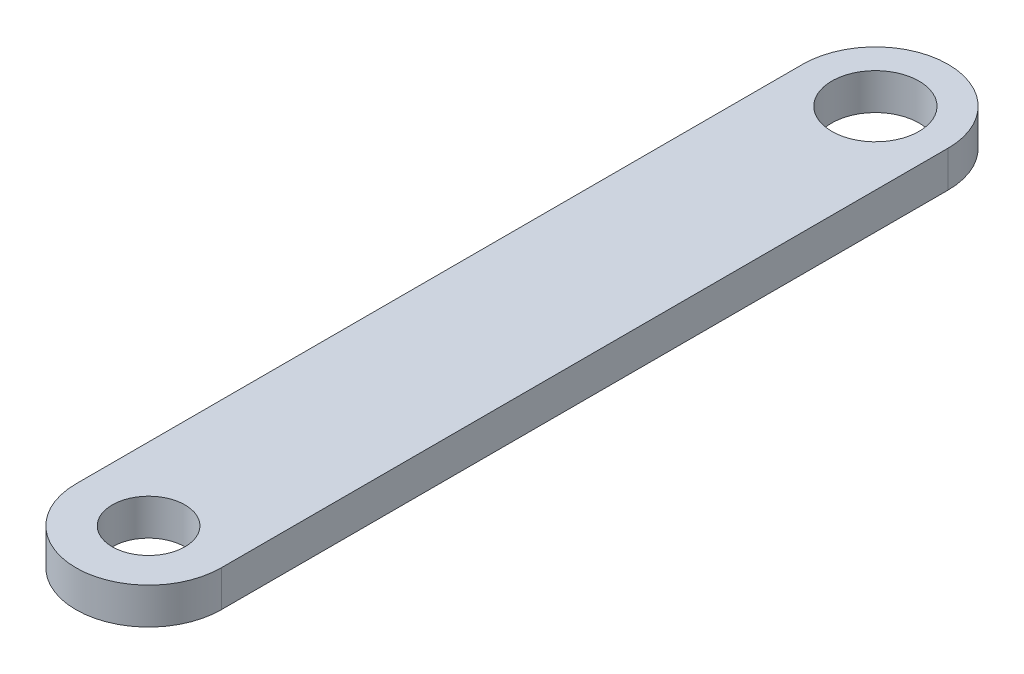
ISO-10303-21;
HEADER;
FILE_DESCRIPTION(('STEP AP214'),'2;1');
FILE_NAME('part.step','',(''),(''),'','','');
FILE_SCHEMA(('AUTOMOTIVE_DESIGN { 1 0 10303 214 1 1 1 1 }'));
ENDSEC;
DATA;
#1=APPLICATION_CONTEXT('core data for automotive mechanical design processes');
#2=APPLICATION_PROTOCOL_DEFINITION('international standard','automotive_design',2000,#1);
#3=PRODUCT_CONTEXT('',#1,'mechanical');
#4=PRODUCT('Part','Part','',(#3));
#5=PRODUCT_RELATED_PRODUCT_CATEGORY('part','',(#4));
#6=PRODUCT_DEFINITION_FORMATION('','',#4);
#7=PRODUCT_DEFINITION_CONTEXT('part definition',#1,'design');
#8=PRODUCT_DEFINITION('design','',#6,#7);
#9=PRODUCT_DEFINITION_SHAPE('','',#8);
#10=(LENGTH_UNIT() NAMED_UNIT(*) SI_UNIT(.MILLI.,.METRE.));
#11=(NAMED_UNIT(*) PLANE_ANGLE_UNIT() SI_UNIT($,.RADIAN.));
#12=(NAMED_UNIT(*) SI_UNIT($,.STERADIAN.) SOLID_ANGLE_UNIT());
#13=UNCERTAINTY_MEASURE_WITH_UNIT(LENGTH_MEASURE(1.E-05),#10,'distance_accuracy_value','');
#14=(GEOMETRIC_REPRESENTATION_CONTEXT(3) GLOBAL_UNCERTAINTY_ASSIGNED_CONTEXT((#13)) GLOBAL_UNIT_ASSIGNED_CONTEXT((#10,
#11,#12)) REPRESENTATION_CONTEXT('',''));
#15=CARTESIAN_POINT('',(0.,0.,0.));
#16=DIRECTION('',(0.,0.,1.));
#17=DIRECTION('',(1.,0.,0.));
#18=AXIS2_PLACEMENT_3D('',#15,#16,#17);
#19=CARTESIAN_POINT('',(0.,5.,0.));
#20=DIRECTION('',(0.,1.,0.));
#21=DIRECTION('',(0.,0.,1.));
#22=AXIS2_PLACEMENT_3D('',#19,#20,#21);
#23=PLANE('',#22);
#24=CARTESIAN_POINT('',(0.,5.,0.));
#25=DIRECTION('',(0.,1.,0.));
#26=DIRECTION('',(0.,0.,1.));
#27=AXIS2_PLACEMENT_3D('',#24,#25,#26);
#28=CIRCLE('',#27,6.);
#29=CARTESIAN_POINT('',(0.,5.,6.));
#30=VERTEX_POINT('',#29);
#31=EDGE_CURVE('E100',#30,#30,#28,.T.);
#32=ORIENTED_EDGE('',*,*,#31,.F.);
#33=EDGE_LOOP('',(#32));
#34=FACE_BOUND('',#33,.T.);
#35=CARTESIAN_POINT('',(0.,5.,0.));
#36=DIRECTION('',(0.,1.,0.));
#37=DIRECTION('',(0.,0.,1.));
#38=AXIS2_PLACEMENT_3D('',#35,#36,#37);
#39=CIRCLE('',#38,10.);
#40=CARTESIAN_POINT('',(10.,5.,0.));
#41=VERTEX_POINT('',#40);
#42=CARTESIAN_POINT('',(-10.,5.,0.));
#43=VERTEX_POINT('',#42);
#44=EDGE_CURVE('E85',#41,#43,#39,.T.);
#45=ORIENTED_EDGE('',*,*,#44,.T.);
#46=DIRECTION('',(0.,0.,1.));
#47=VECTOR('',#46,1.);
#48=CARTESIAN_POINT('',(-10.,5.,0.));
#49=LINE('',#48,#47);
#50=CARTESIAN_POINT('',(-9.99999999999999,5.,100.));
#51=VERTEX_POINT('',#50);
#52=EDGE_CURVE('E80',#43,#51,#49,.T.);
#53=ORIENTED_EDGE('',*,*,#52,.T.);
#54=CARTESIAN_POINT('',(0.,5.,100.));
#55=DIRECTION('',(0.,1.,0.));
#56=DIRECTION('',(0.,0.,1.));
#57=AXIS2_PLACEMENT_3D('',#54,#55,#56);
#58=CIRCLE('',#57,10.);
#59=CARTESIAN_POINT('',(10.,5.,100.));
#60=VERTEX_POINT('',#59);
#61=EDGE_CURVE('E83',#51,#60,#58,.T.);
#62=ORIENTED_EDGE('',*,*,#61,.T.);
#63=DIRECTION('',(0.,0.,-1.));
#64=VECTOR('',#63,1.);
#65=CARTESIAN_POINT('',(10.,5.,0.));
#66=LINE('',#65,#64);
#67=EDGE_CURVE('E50',#60,#41,#66,.T.);
#68=ORIENTED_EDGE('',*,*,#67,.T.);
#69=EDGE_LOOP('',(#45,#53,#62,#68));
#70=FACE_BOUND('',#69,.T.);
#71=CARTESIAN_POINT('',(0.,5.,100.));
#72=DIRECTION('',(0.,1.,0.));
#73=DIRECTION('',(0.,0.,1.));
#74=AXIS2_PLACEMENT_3D('',#71,#72,#73);
#75=CIRCLE('',#74,5.);
#76=CARTESIAN_POINT('',(0.,5.,105.));
#77=VERTEX_POINT('',#76);
#78=EDGE_CURVE('E115',#77,#77,#75,.T.);
#79=ORIENTED_EDGE('',*,*,#78,.F.);
#80=EDGE_LOOP('',(#79));
#81=FACE_BOUND('',#80,.T.);
#82=ADVANCED_FACE('F33',(#34,#70,#81),#23,.T.);
#83=CARTESIAN_POINT('',(0.,0.,0.));
#84=DIRECTION('',(0.,1.,0.));
#85=DIRECTION('',(0.,0.,1.));
#86=AXIS2_PLACEMENT_3D('',#83,#84,#85);
#87=PLANE('',#86);
#88=CARTESIAN_POINT('',(0.,0.,0.));
#89=DIRECTION('',(0.,1.,0.));
#90=DIRECTION('',(0.,0.,1.));
#91=AXIS2_PLACEMENT_3D('',#88,#89,#90);
#92=CIRCLE('',#91,10.);
#93=CARTESIAN_POINT('',(10.,0.,0.));
#94=VERTEX_POINT('',#93);
#95=CARTESIAN_POINT('',(-10.,0.,0.));
#96=VERTEX_POINT('',#95);
#97=EDGE_CURVE('E97',#94,#96,#92,.T.);
#98=ORIENTED_EDGE('',*,*,#97,.F.);
#99=DIRECTION('',(0.,0.,-1.));
#100=VECTOR('',#99,1.);
#101=CARTESIAN_POINT('',(10.,0.,0.));
#102=LINE('',#101,#100);
#103=CARTESIAN_POINT('',(10.,0.,100.));
#104=VERTEX_POINT('',#103);
#105=EDGE_CURVE('E73',#104,#94,#102,.T.);
#106=ORIENTED_EDGE('',*,*,#105,.F.);
#107=CARTESIAN_POINT('',(0.,0.,100.));
#108=DIRECTION('',(0.,1.,0.));
#109=DIRECTION('',(0.,0.,1.));
#110=AXIS2_PLACEMENT_3D('',#107,#108,#109);
#111=CIRCLE('',#110,10.);
#112=CARTESIAN_POINT('',(-9.99999999999999,0.,100.));
#113=VERTEX_POINT('',#112);
#114=EDGE_CURVE('E67',#113,#104,#111,.T.);
#115=ORIENTED_EDGE('',*,*,#114,.F.);
#116=DIRECTION('',(0.,0.,1.));
#117=VECTOR('',#116,1.);
#118=CARTESIAN_POINT('',(-10.,0.,0.));
#119=LINE('',#118,#117);
#120=EDGE_CURVE('E89',#96,#113,#119,.T.);
#121=ORIENTED_EDGE('',*,*,#120,.F.);
#122=EDGE_LOOP('',(#98,#106,#115,#121));
#123=FACE_BOUND('',#122,.T.);
#124=CARTESIAN_POINT('',(0.,0.,0.));
#125=DIRECTION('',(0.,1.,0.));
#126=DIRECTION('',(0.,0.,1.));
#127=AXIS2_PLACEMENT_3D('',#124,#125,#126);
#128=CIRCLE('',#127,6.);
#129=CARTESIAN_POINT('',(0.,0.,6.));
#130=VERTEX_POINT('',#129);
#131=EDGE_CURVE('E112',#130,#130,#128,.T.);
#132=ORIENTED_EDGE('',*,*,#131,.T.);
#133=EDGE_LOOP('',(#132));
#134=FACE_BOUND('',#133,.T.);
#135=CARTESIAN_POINT('',(0.,0.,100.));
#136=DIRECTION('',(0.,1.,0.));
#137=DIRECTION('',(0.,0.,1.));
#138=AXIS2_PLACEMENT_3D('',#135,#136,#137);
#139=CIRCLE('',#138,5.);
#140=CARTESIAN_POINT('',(0.,0.,105.));
#141=VERTEX_POINT('',#140);
#142=EDGE_CURVE('E118',#141,#141,#139,.T.);
#143=ORIENTED_EDGE('',*,*,#142,.T.);
#144=EDGE_LOOP('',(#143));
#145=FACE_BOUND('',#144,.T.);
#146=ADVANCED_FACE('F108',(#123,#134,#145),#87,.F.);
#147=CARTESIAN_POINT('',(0.,5.,0.));
#148=DIRECTION('',(0.,-1.,0.));
#149=DIRECTION('',(0.,0.,-1.));
#150=AXIS2_PLACEMENT_3D('',#147,#148,#149);
#151=CYLINDRICAL_SURFACE('',#150,10.);
#152=ORIENTED_EDGE('',*,*,#97,.T.);
#153=DIRECTION('',(0.,-1.,0.));
#154=VECTOR('',#153,1.);
#155=CARTESIAN_POINT('',(-10.,5.,0.));
#156=LINE('',#155,#154);
#157=EDGE_CURVE('E11',#43,#96,#156,.T.);
#158=ORIENTED_EDGE('',*,*,#157,.F.);
#159=ORIENTED_EDGE('',*,*,#44,.F.);
#160=DIRECTION('',(0.,-1.,0.));
#161=VECTOR('',#160,1.);
#162=CARTESIAN_POINT('',(10.,5.,0.));
#163=LINE('',#162,#161);
#164=EDGE_CURVE('E93',#41,#94,#163,.T.);
#165=ORIENTED_EDGE('',*,*,#164,.T.);
#166=EDGE_LOOP('',(#152,#158,#159,#165));
#167=FACE_BOUND('',#166,.T.);
#168=ADVANCED_FACE('F35',(#167),#151,.T.);
#169=CARTESIAN_POINT('',(-10.,5.,0.));
#170=DIRECTION('',(1.,0.,0.));
#171=DIRECTION('',(0.,0.,-1.));
#172=AXIS2_PLACEMENT_3D('',#169,#170,#171);
#173=PLANE('',#172);
#174=ORIENTED_EDGE('',*,*,#120,.T.);
#175=DIRECTION('',(0.,-1.,0.));
#176=VECTOR('',#175,1.);
#177=CARTESIAN_POINT('',(-9.99999999999999,5.,100.));
#178=LINE('',#177,#176);
#179=EDGE_CURVE('E42',#51,#113,#178,.T.);
#180=ORIENTED_EDGE('',*,*,#179,.F.);
#181=ORIENTED_EDGE('',*,*,#52,.F.);
#182=ORIENTED_EDGE('',*,*,#157,.T.);
#183=EDGE_LOOP('',(#174,#180,#181,#182));
#184=FACE_BOUND('',#183,.T.);
#185=ADVANCED_FACE('F88',(#184),#173,.F.);
#186=CARTESIAN_POINT('',(0.,5.,100.));
#187=DIRECTION('',(0.,-1.,0.));
#188=DIRECTION('',(0.,0.,-1.));
#189=AXIS2_PLACEMENT_3D('',#186,#187,#188);
#190=CYLINDRICAL_SURFACE('',#189,10.);
#191=ORIENTED_EDGE('',*,*,#114,.T.);
#192=DIRECTION('',(0.,-1.,0.));
#193=VECTOR('',#192,1.);
#194=CARTESIAN_POINT('',(10.,5.,100.));
#195=LINE('',#194,#193);
#196=EDGE_CURVE('E90',#60,#104,#195,.T.);
#197=ORIENTED_EDGE('',*,*,#196,.F.);
#198=ORIENTED_EDGE('',*,*,#61,.F.);
#199=ORIENTED_EDGE('',*,*,#179,.T.);
#200=EDGE_LOOP('',(#191,#197,#198,#199));
#201=FACE_BOUND('',#200,.T.);
#202=ADVANCED_FACE('F91',(#201),#190,.T.);
#203=CARTESIAN_POINT('',(10.,5.,0.));
#204=DIRECTION('',(-1.,0.,0.));
#205=DIRECTION('',(0.,0.,1.));
#206=AXIS2_PLACEMENT_3D('',#203,#204,#205);
#207=PLANE('',#206);
#208=ORIENTED_EDGE('',*,*,#105,.T.);
#209=ORIENTED_EDGE('',*,*,#164,.F.);
#210=ORIENTED_EDGE('',*,*,#67,.F.);
#211=ORIENTED_EDGE('',*,*,#196,.T.);
#212=EDGE_LOOP('',(#208,#209,#210,#211));
#213=FACE_BOUND('',#212,.T.);
#214=ADVANCED_FACE('F105',(#213),#207,.F.);
#215=CARTESIAN_POINT('',(0.,5.,0.));
#216=DIRECTION('',(0.,-1.,0.));
#217=DIRECTION('',(0.,0.,-1.));
#218=AXIS2_PLACEMENT_3D('',#215,#216,#217);
#219=CYLINDRICAL_SURFACE('',#218,6.);
#220=ORIENTED_EDGE('',*,*,#31,.T.);
#221=EDGE_LOOP('',(#220));
#222=FACE_BOUND('',#221,.T.);
#223=ORIENTED_EDGE('',*,*,#131,.F.);
#224=EDGE_LOOP('',(#223));
#225=FACE_BOUND('',#224,.T.);
#226=ADVANCED_FACE('F135',(#222,#225),#219,.F.);
#227=CARTESIAN_POINT('',(0.,5.,100.));
#228=DIRECTION('',(0.,-1.,0.));
#229=DIRECTION('',(0.,0.,-1.));
#230=AXIS2_PLACEMENT_3D('',#227,#228,#229);
#231=CYLINDRICAL_SURFACE('',#230,5.);
#232=ORIENTED_EDGE('',*,*,#78,.T.);
#233=EDGE_LOOP('',(#232));
#234=FACE_BOUND('',#233,.T.);
#235=ORIENTED_EDGE('',*,*,#142,.F.);
#236=EDGE_LOOP('',(#235));
#237=FACE_BOUND('',#236,.T.);
#238=ADVANCED_FACE('F124',(#234,#237),#231,.F.);
#239=CLOSED_SHELL('',(#82,#146,#168,#185,#202,#214,#226,#238));
#240=MANIFOLD_SOLID_BREP('B2',#239);
#241=ADVANCED_BREP_SHAPE_REPRESENTATION('',(#18,#240),#14);
#242=SHAPE_DEFINITION_REPRESENTATION(#9,#241);
ENDSEC;
END-ISO-10303-21;
